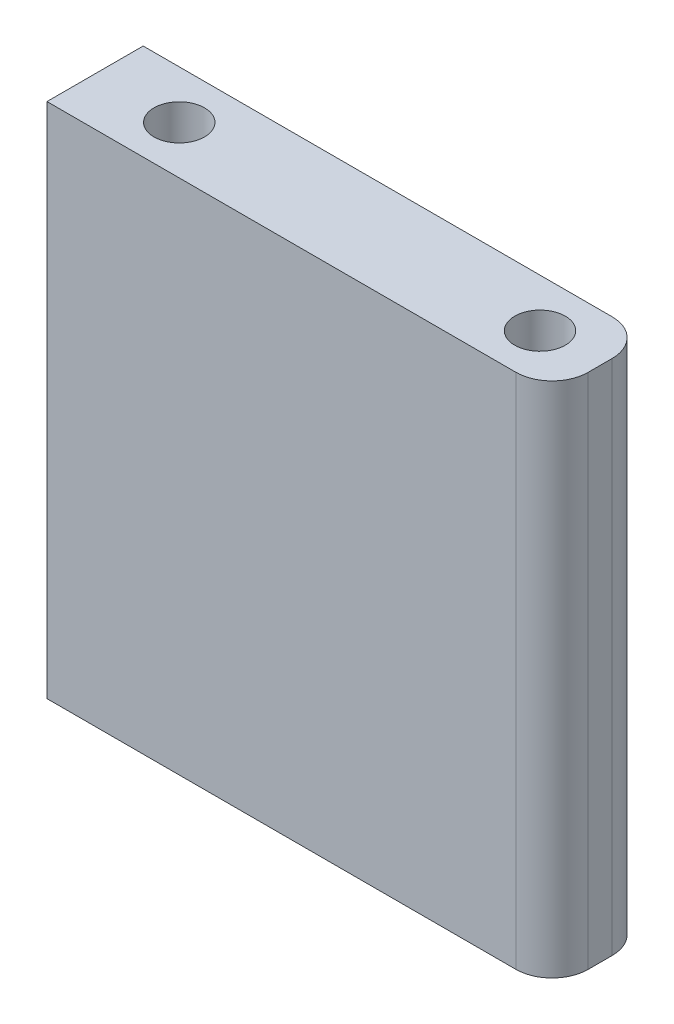
ISO-10303-21;
HEADER;
FILE_DESCRIPTION(('STEP AP214'),'2;1');
FILE_NAME('part.step','',(''),(''),'','','');
FILE_SCHEMA(('AUTOMOTIVE_DESIGN { 1 0 10303 214 1 1 1 1 }'));
ENDSEC;
DATA;
#1=APPLICATION_CONTEXT('core data for automotive mechanical design processes');
#2=APPLICATION_PROTOCOL_DEFINITION('international standard','automotive_design',2000,#1);
#3=PRODUCT_CONTEXT('',#1,'mechanical');
#4=PRODUCT('Part','Part','',(#3));
#5=PRODUCT_RELATED_PRODUCT_CATEGORY('part','',(#4));
#6=PRODUCT_DEFINITION_FORMATION('','',#4);
#7=PRODUCT_DEFINITION_CONTEXT('part definition',#1,'design');
#8=PRODUCT_DEFINITION('design','',#6,#7);
#9=PRODUCT_DEFINITION_SHAPE('','',#8);
#10=(LENGTH_UNIT() NAMED_UNIT(*) SI_UNIT(.MILLI.,.METRE.));
#11=(NAMED_UNIT(*) PLANE_ANGLE_UNIT() SI_UNIT($,.RADIAN.));
#12=(NAMED_UNIT(*) SI_UNIT($,.STERADIAN.) SOLID_ANGLE_UNIT());
#13=UNCERTAINTY_MEASURE_WITH_UNIT(LENGTH_MEASURE(1.E-05),#10,'distance_accuracy_value','');
#14=(GEOMETRIC_REPRESENTATION_CONTEXT(3) GLOBAL_UNCERTAINTY_ASSIGNED_CONTEXT((#13)) GLOBAL_UNIT_ASSIGNED_CONTEXT((#10,
#11,#12)) REPRESENTATION_CONTEXT('',''));
#15=CARTESIAN_POINT('',(0.,0.,0.));
#16=DIRECTION('',(0.,0.,1.));
#17=DIRECTION('',(1.,0.,0.));
#18=AXIS2_PLACEMENT_3D('',#15,#16,#17);
#19=CARTESIAN_POINT('',(0.,0.,8.));
#20=DIRECTION('',(1.,0.,0.));
#21=DIRECTION('',(0.,0.,-1.));
#22=AXIS2_PLACEMENT_3D('',#19,#20,#21);
#23=PLANE('',#22);
#24=DIRECTION('',(0.,-1.,0.));
#25=VECTOR('',#24,1.);
#26=CARTESIAN_POINT('',(0.,0.,0.));
#27=LINE('',#26,#25);
#28=CARTESIAN_POINT('',(0.,43.,0.));
#29=VERTEX_POINT('',#28);
#30=CARTESIAN_POINT('',(0.,0.,0.));
#31=VERTEX_POINT('',#30);
#32=EDGE_CURVE('E110',#29,#31,#27,.T.);
#33=ORIENTED_EDGE('',*,*,#32,.T.);
#34=DIRECTION('',(0.,0.,-1.));
#35=VECTOR('',#34,1.);
#36=CARTESIAN_POINT('',(0.,0.,8.));
#37=LINE('',#36,#35);
#38=CARTESIAN_POINT('',(0.,0.,8.));
#39=VERTEX_POINT('',#38);
#40=EDGE_CURVE('E94',#39,#31,#37,.T.);
#41=ORIENTED_EDGE('',*,*,#40,.F.);
#42=DIRECTION('',(0.,-1.,0.));
#43=VECTOR('',#42,1.);
#44=CARTESIAN_POINT('',(0.,0.,8.));
#45=LINE('',#44,#43);
#46=CARTESIAN_POINT('',(0.,43.,8.));
#47=VERTEX_POINT('',#46);
#48=EDGE_CURVE('E99',#47,#39,#45,.T.);
#49=ORIENTED_EDGE('',*,*,#48,.F.);
#50=DIRECTION('',(0.,0.,-1.));
#51=VECTOR('',#50,1.);
#52=CARTESIAN_POINT('',(0.,43.,8.));
#53=LINE('',#52,#51);
#54=EDGE_CURVE('E145',#47,#29,#53,.T.);
#55=ORIENTED_EDGE('',*,*,#54,.T.);
#56=EDGE_LOOP('',(#33,#41,#49,#55));
#57=FACE_BOUND('',#56,.T.);
#58=ADVANCED_FACE('F37',(#57),#23,.F.);
#59=CARTESIAN_POINT('',(0.,0.,8.));
#60=DIRECTION('',(0.,1.,0.));
#61=DIRECTION('',(0.,0.,1.));
#62=AXIS2_PLACEMENT_3D('',#59,#60,#61);
#63=PLANE('',#62);
#64=CARTESIAN_POINT('',(7.00000000000001,0.,3.99999999999979));
#65=DIRECTION('',(0.,-1.,0.));
#66=DIRECTION('',(0.,0.,-1.));
#67=AXIS2_PLACEMENT_3D('',#64,#65,#66);
#68=CIRCLE('',#67,2.1);
#69=CARTESIAN_POINT('',(7.00000000000001,0.,1.89999999999979));
#70=VERTEX_POINT('',#69);
#71=EDGE_CURVE('E149',#70,#70,#68,.T.);
#72=ORIENTED_EDGE('',*,*,#71,.F.);
#73=EDGE_LOOP('',(#72));
#74=FACE_BOUND('',#73,.T.);
#75=CARTESIAN_POINT('',(37.,0.,4.));
#76=DIRECTION('',(0.,-1.,0.));
#77=DIRECTION('',(0.,0.,-1.));
#78=AXIS2_PLACEMENT_3D('',#75,#76,#77);
#79=CIRCLE('',#78,2.1);
#80=CARTESIAN_POINT('',(37.,0.,1.9));
#81=VERTEX_POINT('',#80);
#82=EDGE_CURVE('E162',#81,#81,#79,.T.);
#83=ORIENTED_EDGE('',*,*,#82,.F.);
#84=EDGE_LOOP('',(#83));
#85=FACE_BOUND('',#84,.T.);
#86=DIRECTION('',(1.,0.,0.));
#87=VECTOR('',#86,1.);
#88=CARTESIAN_POINT('',(0.,0.,0.));
#89=LINE('',#88,#87);
#90=CARTESIAN_POINT('',(39.,0.,0.));
#91=VERTEX_POINT('',#90);
#92=EDGE_CURVE('E129',#31,#91,#89,.T.);
#93=ORIENTED_EDGE('',*,*,#92,.T.);
#94=CARTESIAN_POINT('',(39.,0.,3.));
#95=DIRECTION('',(0.,1.,0.));
#96=DIRECTION('',(0.,0.,1.));
#97=AXIS2_PLACEMENT_3D('',#94,#95,#96);
#98=CIRCLE('',#97,3.);
#99=CARTESIAN_POINT('',(42.,0.,3.));
#100=VERTEX_POINT('',#99);
#101=EDGE_CURVE('E45',#91,#100,#98,.F.);
#102=ORIENTED_EDGE('',*,*,#101,.T.);
#103=DIRECTION('',(0.,0.,-1.));
#104=VECTOR('',#103,1.);
#105=CARTESIAN_POINT('',(42.,0.,8.));
#106=LINE('',#105,#104);
#107=CARTESIAN_POINT('',(42.,0.,5.));
#108=VERTEX_POINT('',#107);
#109=EDGE_CURVE('E112',#108,#100,#106,.T.);
#110=ORIENTED_EDGE('',*,*,#109,.F.);
#111=CARTESIAN_POINT('',(39.,0.,5.));
#112=DIRECTION('',(0.,1.,0.));
#113=DIRECTION('',(0.,0.,1.));
#114=AXIS2_PLACEMENT_3D('',#111,#112,#113);
#115=CIRCLE('',#114,3.);
#116=CARTESIAN_POINT('',(39.,0.,8.));
#117=VERTEX_POINT('',#116);
#118=EDGE_CURVE('E52',#108,#117,#115,.F.);
#119=ORIENTED_EDGE('',*,*,#118,.T.);
#120=DIRECTION('',(1.,0.,0.));
#121=VECTOR('',#120,1.);
#122=CARTESIAN_POINT('',(0.,0.,8.));
#123=LINE('',#122,#121);
#124=EDGE_CURVE('E90',#39,#117,#123,.T.);
#125=ORIENTED_EDGE('',*,*,#124,.F.);
#126=ORIENTED_EDGE('',*,*,#40,.T.);
#127=EDGE_LOOP('',(#93,#102,#110,#119,#125,#126));
#128=FACE_BOUND('',#127,.T.);
#129=ADVANCED_FACE('F92',(#74,#85,#128),#63,.F.);
#130=CARTESIAN_POINT('',(42.,0.,8.));
#131=DIRECTION('',(-1.,0.,0.));
#132=DIRECTION('',(0.,0.,1.));
#133=AXIS2_PLACEMENT_3D('',#130,#131,#132);
#134=PLANE('',#133);
#135=ORIENTED_EDGE('',*,*,#109,.T.);
#136=DIRECTION('',(0.,1.,0.));
#137=VECTOR('',#136,1.);
#138=CARTESIAN_POINT('',(42.,43.,3.));
#139=LINE('',#138,#137);
#140=CARTESIAN_POINT('',(42.,43.,3.));
#141=VERTEX_POINT('',#140);
#142=EDGE_CURVE('E114',#100,#141,#139,.T.);
#143=ORIENTED_EDGE('',*,*,#142,.T.);
#144=DIRECTION('',(0.,0.,-1.));
#145=VECTOR('',#144,1.);
#146=CARTESIAN_POINT('',(42.,43.,8.));
#147=LINE('',#146,#145);
#148=CARTESIAN_POINT('',(42.,43.,5.));
#149=VERTEX_POINT('',#148);
#150=EDGE_CURVE('E117',#149,#141,#147,.T.);
#151=ORIENTED_EDGE('',*,*,#150,.F.);
#152=DIRECTION('',(0.,1.,0.));
#153=VECTOR('',#152,1.);
#154=CARTESIAN_POINT('',(42.,0.,5.));
#155=LINE('',#154,#153);
#156=EDGE_CURVE('E111',#149,#108,#155,.F.);
#157=ORIENTED_EDGE('',*,*,#156,.T.);
#158=EDGE_LOOP('',(#135,#143,#151,#157));
#159=FACE_BOUND('',#158,.T.);
#160=ADVANCED_FACE('F133',(#159),#134,.F.);
#161=CARTESIAN_POINT('',(0.,43.,8.));
#162=DIRECTION('',(0.,-1.,0.));
#163=DIRECTION('',(0.,0.,-1.));
#164=AXIS2_PLACEMENT_3D('',#161,#162,#163);
#165=PLANE('',#164);
#166=CARTESIAN_POINT('',(37.,43.,4.));
#167=DIRECTION('',(0.,1.,0.));
#168=DIRECTION('',(0.,0.,1.));
#169=AXIS2_PLACEMENT_3D('',#166,#167,#168);
#170=CIRCLE('',#169,2.1);
#171=CARTESIAN_POINT('',(37.,43.,6.1));
#172=VERTEX_POINT('',#171);
#173=EDGE_CURVE('E168',#172,#172,#170,.T.);
#174=ORIENTED_EDGE('',*,*,#173,.F.);
#175=EDGE_LOOP('',(#174));
#176=FACE_BOUND('',#175,.T.);
#177=CARTESIAN_POINT('',(7.00000000000001,43.,4.00000000000021));
#178=DIRECTION('',(0.,1.,0.));
#179=DIRECTION('',(0.,0.,1.));
#180=AXIS2_PLACEMENT_3D('',#177,#178,#179);
#181=CIRCLE('',#180,2.1);
#182=CARTESIAN_POINT('',(7.00000000000001,43.,6.10000000000021));
#183=VERTEX_POINT('',#182);
#184=EDGE_CURVE('E157',#183,#183,#181,.T.);
#185=ORIENTED_EDGE('',*,*,#184,.F.);
#186=EDGE_LOOP('',(#185));
#187=FACE_BOUND('',#186,.T.);
#188=ORIENTED_EDGE('',*,*,#150,.T.);
#189=CARTESIAN_POINT('',(39.,43.,3.));
#190=DIRECTION('',(0.,-1.,0.));
#191=DIRECTION('',(0.,0.,-1.));
#192=AXIS2_PLACEMENT_3D('',#189,#190,#191);
#193=CIRCLE('',#192,3.);
#194=CARTESIAN_POINT('',(39.,43.,0.));
#195=VERTEX_POINT('',#194);
#196=EDGE_CURVE('E125',#141,#195,#193,.F.);
#197=ORIENTED_EDGE('',*,*,#196,.T.);
#198=DIRECTION('',(-1.,0.,0.));
#199=VECTOR('',#198,1.);
#200=CARTESIAN_POINT('',(0.,43.,0.));
#201=LINE('',#200,#199);
#202=EDGE_CURVE('E107',#195,#29,#201,.T.);
#203=ORIENTED_EDGE('',*,*,#202,.T.);
#204=ORIENTED_EDGE('',*,*,#54,.F.);
#205=DIRECTION('',(-1.,0.,0.));
#206=VECTOR('',#205,1.);
#207=CARTESIAN_POINT('',(0.,43.,8.));
#208=LINE('',#207,#206);
#209=CARTESIAN_POINT('',(39.,43.,8.));
#210=VERTEX_POINT('',#209);
#211=EDGE_CURVE('E98',#210,#47,#208,.T.);
#212=ORIENTED_EDGE('',*,*,#211,.F.);
#213=CARTESIAN_POINT('',(39.,43.,5.));
#214=DIRECTION('',(0.,-1.,0.));
#215=DIRECTION('',(0.,0.,-1.));
#216=AXIS2_PLACEMENT_3D('',#213,#214,#215);
#217=CIRCLE('',#216,3.);
#218=EDGE_CURVE('E123',#210,#149,#217,.F.);
#219=ORIENTED_EDGE('',*,*,#218,.T.);
#220=EDGE_LOOP('',(#188,#197,#203,#204,#212,#219));
#221=FACE_BOUND('',#220,.T.);
#222=ADVANCED_FACE('F139',(#176,#187,#221),#165,.F.);
#223=CARTESIAN_POINT('',(0.,0.,8.));
#224=DIRECTION('',(0.,0.,-1.));
#225=DIRECTION('',(-1.,0.,0.));
#226=AXIS2_PLACEMENT_3D('',#223,#224,#225);
#227=PLANE('',#226);
#228=ORIENTED_EDGE('',*,*,#124,.T.);
#229=DIRECTION('',(0.,1.,0.));
#230=VECTOR('',#229,1.);
#231=CARTESIAN_POINT('',(39.,0.,8.));
#232=LINE('',#231,#230);
#233=EDGE_CURVE('E11',#117,#210,#232,.T.);
#234=ORIENTED_EDGE('',*,*,#233,.T.);
#235=ORIENTED_EDGE('',*,*,#211,.T.);
#236=ORIENTED_EDGE('',*,*,#48,.T.);
#237=EDGE_LOOP('',(#228,#234,#235,#236));
#238=FACE_BOUND('',#237,.T.);
#239=ADVANCED_FACE('F102',(#238),#227,.F.);
#240=CARTESIAN_POINT('',(0.,0.,0.));
#241=DIRECTION('',(0.,0.,-1.));
#242=DIRECTION('',(-1.,0.,0.));
#243=AXIS2_PLACEMENT_3D('',#240,#241,#242);
#244=PLANE('',#243);
#245=ORIENTED_EDGE('',*,*,#202,.F.);
#246=DIRECTION('',(0.,1.,0.));
#247=VECTOR('',#246,1.);
#248=CARTESIAN_POINT('',(39.,0.,0.));
#249=LINE('',#248,#247);
#250=EDGE_CURVE('E60',#195,#91,#249,.F.);
#251=ORIENTED_EDGE('',*,*,#250,.T.);
#252=ORIENTED_EDGE('',*,*,#92,.F.);
#253=ORIENTED_EDGE('',*,*,#32,.F.);
#254=EDGE_LOOP('',(#245,#251,#252,#253));
#255=FACE_BOUND('',#254,.T.);
#256=ADVANCED_FACE('F140',(#255),#244,.T.);
#257=CARTESIAN_POINT('',(37.,10.,4.));
#258=DIRECTION('',(0.,-1.,0.));
#259=DIRECTION('',(0.,0.,-1.));
#260=AXIS2_PLACEMENT_3D('',#257,#258,#259);
#261=CYLINDRICAL_SURFACE('',#260,2.1);
#262=CARTESIAN_POINT('',(37.,10.,4.));
#263=DIRECTION('',(0.,-1.,0.));
#264=DIRECTION('',(0.,0.,-1.));
#265=AXIS2_PLACEMENT_3D('',#262,#263,#264);
#266=CIRCLE('',#265,2.1);
#267=CARTESIAN_POINT('',(37.,10.,1.9));
#268=VERTEX_POINT('',#267);
#269=EDGE_CURVE('E154',#268,#268,#266,.T.);
#270=ORIENTED_EDGE('',*,*,#269,.F.);
#271=EDGE_LOOP('',(#270));
#272=FACE_BOUND('',#271,.T.);
#273=ORIENTED_EDGE('',*,*,#82,.T.);
#274=EDGE_LOOP('',(#273));
#275=FACE_BOUND('',#274,.T.);
#276=ADVANCED_FACE('F232',(#272,#275),#261,.F.);
#277=CARTESIAN_POINT('',(0.,10.,0.));
#278=DIRECTION('',(0.,-1.,0.));
#279=DIRECTION('',(0.,0.,-1.));
#280=AXIS2_PLACEMENT_3D('',#277,#278,#279);
#281=PLANE('',#280);
#282=ORIENTED_EDGE('',*,*,#269,.T.);
#283=EDGE_LOOP('',(#282));
#284=FACE_BOUND('',#283,.T.);
#285=ADVANCED_FACE('F228',(#284),#281,.T.);
#286=CARTESIAN_POINT('',(7.00000000000001,10.,3.99999999999979));
#287=DIRECTION('',(0.,-1.,0.));
#288=DIRECTION('',(0.,0.,-1.));
#289=AXIS2_PLACEMENT_3D('',#286,#287,#288);
#290=CYLINDRICAL_SURFACE('',#289,2.1);
#291=CARTESIAN_POINT('',(7.00000000000001,10.,3.99999999999979));
#292=DIRECTION('',(0.,-1.,0.));
#293=DIRECTION('',(0.,0.,-1.));
#294=AXIS2_PLACEMENT_3D('',#291,#292,#293);
#295=CIRCLE('',#294,2.1);
#296=CARTESIAN_POINT('',(7.00000000000001,10.,1.89999999999979));
#297=VERTEX_POINT('',#296);
#298=EDGE_CURVE('E147',#297,#297,#295,.T.);
#299=ORIENTED_EDGE('',*,*,#298,.F.);
#300=EDGE_LOOP('',(#299));
#301=FACE_BOUND('',#300,.T.);
#302=ORIENTED_EDGE('',*,*,#71,.T.);
#303=EDGE_LOOP('',(#302));
#304=FACE_BOUND('',#303,.T.);
#305=ADVANCED_FACE('F225',(#301,#304),#290,.F.);
#306=CARTESIAN_POINT('',(0.,10.,0.));
#307=DIRECTION('',(0.,-1.,0.));
#308=DIRECTION('',(0.,0.,-1.));
#309=AXIS2_PLACEMENT_3D('',#306,#307,#308);
#310=PLANE('',#309);
#311=ORIENTED_EDGE('',*,*,#298,.T.);
#312=EDGE_LOOP('',(#311));
#313=FACE_BOUND('',#312,.T.);
#314=ADVANCED_FACE('F221',(#313),#310,.T.);
#315=CARTESIAN_POINT('',(7.00000000000001,33.,4.00000000000021));
#316=DIRECTION('',(0.,1.,0.));
#317=DIRECTION('',(0.,0.,1.));
#318=AXIS2_PLACEMENT_3D('',#315,#316,#317);
#319=CYLINDRICAL_SURFACE('',#318,2.1);
#320=CARTESIAN_POINT('',(7.00000000000001,33.,4.00000000000021));
#321=DIRECTION('',(0.,1.,0.));
#322=DIRECTION('',(0.,0.,1.));
#323=AXIS2_PLACEMENT_3D('',#320,#321,#322);
#324=CIRCLE('',#323,2.1);
#325=CARTESIAN_POINT('',(7.00000000000001,33.,6.10000000000021));
#326=VERTEX_POINT('',#325);
#327=EDGE_CURVE('E173',#326,#326,#324,.T.);
#328=ORIENTED_EDGE('',*,*,#327,.F.);
#329=EDGE_LOOP('',(#328));
#330=FACE_BOUND('',#329,.T.);
#331=ORIENTED_EDGE('',*,*,#184,.T.);
#332=EDGE_LOOP('',(#331));
#333=FACE_BOUND('',#332,.T.);
#334=ADVANCED_FACE('F181',(#330,#333),#319,.F.);
#335=CARTESIAN_POINT('',(7.00000000000001,33.,4.00000000000021));
#336=DIRECTION('',(0.,1.,0.));
#337=DIRECTION('',(0.,0.,1.));
#338=AXIS2_PLACEMENT_3D('',#335,#336,#337);
#339=PLANE('',#338);
#340=ORIENTED_EDGE('',*,*,#327,.T.);
#341=EDGE_LOOP('',(#340));
#342=FACE_BOUND('',#341,.T.);
#343=ADVANCED_FACE('F213',(#342),#339,.T.);
#344=CARTESIAN_POINT('',(37.,33.,4.));
#345=DIRECTION('',(0.,1.,0.));
#346=DIRECTION('',(0.,0.,1.));
#347=AXIS2_PLACEMENT_3D('',#344,#345,#346);
#348=CYLINDRICAL_SURFACE('',#347,2.1);
#349=CARTESIAN_POINT('',(37.,33.,4.));
#350=DIRECTION('',(0.,1.,0.));
#351=DIRECTION('',(0.,0.,1.));
#352=AXIS2_PLACEMENT_3D('',#349,#350,#351);
#353=CIRCLE('',#352,2.1);
#354=CARTESIAN_POINT('',(37.,33.,6.1));
#355=VERTEX_POINT('',#354);
#356=EDGE_CURVE('E164',#355,#355,#353,.T.);
#357=ORIENTED_EDGE('',*,*,#356,.F.);
#358=EDGE_LOOP('',(#357));
#359=FACE_BOUND('',#358,.T.);
#360=ORIENTED_EDGE('',*,*,#173,.T.);
#361=EDGE_LOOP('',(#360));
#362=FACE_BOUND('',#361,.T.);
#363=ADVANCED_FACE('F208',(#359,#362),#348,.F.);
#364=CARTESIAN_POINT('',(37.,33.,4.));
#365=DIRECTION('',(0.,1.,0.));
#366=DIRECTION('',(0.,0.,1.));
#367=AXIS2_PLACEMENT_3D('',#364,#365,#366);
#368=PLANE('',#367);
#369=ORIENTED_EDGE('',*,*,#356,.T.);
#370=EDGE_LOOP('',(#369));
#371=FACE_BOUND('',#370,.T.);
#372=ADVANCED_FACE('F202',(#371),#368,.T.);
#373=CARTESIAN_POINT('',(39.,0.,3.));
#374=DIRECTION('',(0.,-1.,0.));
#375=DIRECTION('',(0.,0.,-1.));
#376=AXIS2_PLACEMENT_3D('',#373,#374,#375);
#377=CYLINDRICAL_SURFACE('',#376,3.);
#378=ORIENTED_EDGE('',*,*,#101,.F.);
#379=ORIENTED_EDGE('',*,*,#250,.F.);
#380=ORIENTED_EDGE('',*,*,#196,.F.);
#381=ORIENTED_EDGE('',*,*,#142,.F.);
#382=EDGE_LOOP('',(#378,#379,#380,#381));
#383=FACE_BOUND('',#382,.T.);
#384=ADVANCED_FACE('F137',(#383),#377,.T.);
#385=CARTESIAN_POINT('',(39.,0.,5.));
#386=DIRECTION('',(0.,1.,0.));
#387=DIRECTION('',(0.,0.,1.));
#388=AXIS2_PLACEMENT_3D('',#385,#386,#387);
#389=CYLINDRICAL_SURFACE('',#388,3.);
#390=ORIENTED_EDGE('',*,*,#118,.F.);
#391=ORIENTED_EDGE('',*,*,#156,.F.);
#392=ORIENTED_EDGE('',*,*,#218,.F.);
#393=ORIENTED_EDGE('',*,*,#233,.F.);
#394=EDGE_LOOP('',(#390,#391,#392,#393));
#395=FACE_BOUND('',#394,.T.);
#396=ADVANCED_FACE('F39',(#395),#389,.T.);
#397=CLOSED_SHELL('',(#58,#129,#160,#222,#239,#256,#276,#285,#305,#314,#334,#343,#363,#372,#384,#396));
#398=MANIFOLD_SOLID_BREP('B2',#397);
#399=ADVANCED_BREP_SHAPE_REPRESENTATION('',(#18,#398),#14);
#400=SHAPE_DEFINITION_REPRESENTATION(#9,#399);
ENDSEC;
END-ISO-10303-21;
